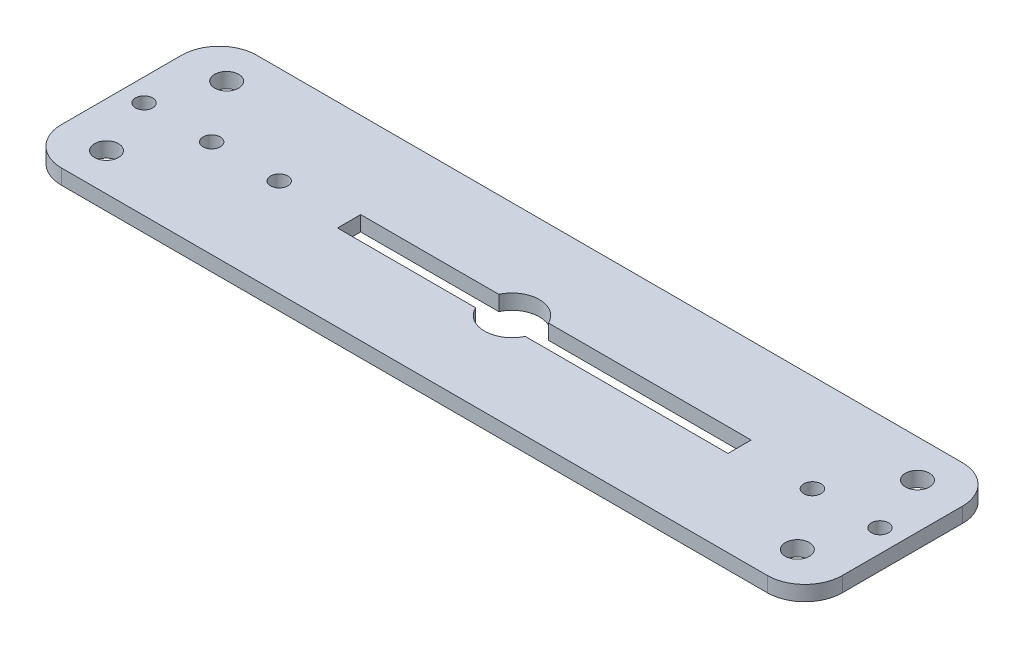
ISO-10303-21;
HEADER;
FILE_DESCRIPTION(('STEP AP214'),'2;1');
FILE_NAME('part.step','',(''),(''),'','','');
FILE_SCHEMA(('AUTOMOTIVE_DESIGN { 1 0 10303 214 1 1 1 1 }'));
ENDSEC;
DATA;
#1=APPLICATION_CONTEXT('core data for automotive mechanical design processes');
#2=APPLICATION_PROTOCOL_DEFINITION('international standard','automotive_design',2000,#1);
#3=PRODUCT_CONTEXT('',#1,'mechanical');
#4=PRODUCT('Part','Part','',(#3));
#5=PRODUCT_RELATED_PRODUCT_CATEGORY('part','',(#4));
#6=PRODUCT_DEFINITION_FORMATION('','',#4);
#7=PRODUCT_DEFINITION_CONTEXT('part definition',#1,'design');
#8=PRODUCT_DEFINITION('design','',#6,#7);
#9=PRODUCT_DEFINITION_SHAPE('','',#8);
#10=(LENGTH_UNIT() NAMED_UNIT(*) SI_UNIT(.MILLI.,.METRE.));
#11=(NAMED_UNIT(*) PLANE_ANGLE_UNIT() SI_UNIT($,.RADIAN.));
#12=(NAMED_UNIT(*) SI_UNIT($,.STERADIAN.) SOLID_ANGLE_UNIT());
#13=UNCERTAINTY_MEASURE_WITH_UNIT(LENGTH_MEASURE(1.E-05),#10,'distance_accuracy_value','');
#14=(GEOMETRIC_REPRESENTATION_CONTEXT(3) GLOBAL_UNCERTAINTY_ASSIGNED_CONTEXT((#13)) GLOBAL_UNIT_ASSIGNED_CONTEXT((#10,
#11,#12)) REPRESENTATION_CONTEXT('',''));
#15=CARTESIAN_POINT('',(0.,0.,0.));
#16=DIRECTION('',(0.,0.,1.));
#17=DIRECTION('',(1.,0.,0.));
#18=AXIS2_PLACEMENT_3D('',#15,#16,#17);
#19=CARTESIAN_POINT('',(47.,2.,-8.));
#20=DIRECTION('',(0.,1.,0.));
#21=DIRECTION('',(0.,0.,1.));
#22=AXIS2_PLACEMENT_3D('',#19,#20,#21);
#23=PLANE('',#22);
#24=CARTESIAN_POINT('',(-40.,2.,8.3410387465618E-13));
#25=DIRECTION('',(0.,1.,0.));
#26=DIRECTION('',(0.,0.,1.));
#27=AXIS2_PLACEMENT_3D('',#24,#25,#26);
#28=CIRCLE('',#27,1.15);
#29=CARTESIAN_POINT('',(-40.,2.,1.15000000000083));
#30=VERTEX_POINT('',#29);
#31=EDGE_CURVE('E412',#30,#30,#28,.T.);
#32=ORIENTED_EDGE('',*,*,#31,.F.);
#33=EDGE_LOOP('',(#32));
#34=FACE_BOUND('',#33,.T.);
#35=CARTESIAN_POINT('',(-46.,2.,-7.99999999999931));
#36=DIRECTION('',(0.,1.,0.));
#37=DIRECTION('',(0.,0.,1.));
#38=AXIS2_PLACEMENT_3D('',#35,#36,#37);
#39=CIRCLE('',#38,1.6);
#40=CARTESIAN_POINT('',(-46.,2.,-6.39999999999931));
#41=VERTEX_POINT('',#40);
#42=EDGE_CURVE('E424',#41,#41,#39,.T.);
#43=ORIENTED_EDGE('',*,*,#42,.F.);
#44=EDGE_LOOP('',(#43));
#45=FACE_BOUND('',#44,.T.);
#46=CARTESIAN_POINT('',(40.,2.,0.));
#47=DIRECTION('',(0.,1.,0.));
#48=DIRECTION('',(0.,0.,1.));
#49=AXIS2_PLACEMENT_3D('',#46,#47,#48);
#50=CIRCLE('',#49,1.15);
#51=CARTESIAN_POINT('',(40.,2.,1.14999999999999));
#52=VERTEX_POINT('',#51);
#53=EDGE_CURVE('E436',#52,#52,#50,.T.);
#54=ORIENTED_EDGE('',*,*,#53,.F.);
#55=EDGE_LOOP('',(#54));
#56=FACE_BOUND('',#55,.T.);
#57=CARTESIAN_POINT('',(46.,2.,8.));
#58=DIRECTION('',(0.,1.,0.));
#59=DIRECTION('',(0.,0.,1.));
#60=AXIS2_PLACEMENT_3D('',#57,#58,#59);
#61=CIRCLE('',#60,1.6);
#62=CARTESIAN_POINT('',(46.,2.,9.6));
#63=VERTEX_POINT('',#62);
#64=EDGE_CURVE('E448',#63,#63,#61,.T.);
#65=ORIENTED_EDGE('',*,*,#64,.F.);
#66=EDGE_LOOP('',(#65));
#67=FACE_BOUND('',#66,.T.);
#68=DIRECTION('',(-1.,0.,0.));
#69=VECTOR('',#68,1.);
#70=CARTESIAN_POINT('',(3.30714399453822,2.,-1.54444119324422));
#71=LINE('',#70,#69);
#72=CARTESIAN_POINT('',(30.3071439945382,2.,-1.54444119324422));
#73=VERTEX_POINT('',#72);
#74=CARTESIAN_POINT('',(3.30714399453822,2.,-1.54444119324422));
#75=VERTEX_POINT('',#74);
#76=EDGE_CURVE('E157',#73,#75,#71,.T.);
#77=ORIENTED_EDGE('',*,*,#76,.F.);
#78=DIRECTION('',(0.,0.,-1.));
#79=VECTOR('',#78,1.);
#80=CARTESIAN_POINT('',(30.3071439945382,2.,-1.54444119324422));
#81=LINE('',#80,#79);
#82=CARTESIAN_POINT('',(30.3071439945382,2.,1.54444119324422));
#83=VERTEX_POINT('',#82);
#84=EDGE_CURVE('E149',#83,#73,#81,.T.);
#85=ORIENTED_EDGE('',*,*,#84,.F.);
#86=DIRECTION('',(1.,0.,0.));
#87=VECTOR('',#86,1.);
#88=CARTESIAN_POINT('',(3.30714399453821,2.,1.54444119324422));
#89=LINE('',#88,#87);
#90=CARTESIAN_POINT('',(3.30714399453821,2.,1.54444119324423));
#91=VERTEX_POINT('',#90);
#92=EDGE_CURVE('E184',#91,#83,#89,.T.);
#93=ORIENTED_EDGE('',*,*,#92,.F.);
#94=CARTESIAN_POINT('',(0.,2.,0.));
#95=DIRECTION('',(0.,1.,0.));
#96=DIRECTION('',(0.,0.,1.));
#97=AXIS2_PLACEMENT_3D('',#94,#95,#96);
#98=CIRCLE('',#97,3.65);
#99=CARTESIAN_POINT('',(-3.30714399453827,2.,1.54444119324422));
#100=VERTEX_POINT('',#99);
#101=EDGE_CURVE('E182',#100,#91,#98,.T.);
#102=ORIENTED_EDGE('',*,*,#101,.F.);
#103=DIRECTION('',(1.,0.,0.));
#104=VECTOR('',#103,1.);
#105=CARTESIAN_POINT('',(-21.6928560054618,2.,1.54444119324422));
#106=LINE('',#105,#104);
#107=CARTESIAN_POINT('',(-21.6928560054618,2.,1.54444119324422));
#108=VERTEX_POINT('',#107);
#109=EDGE_CURVE('E180',#108,#100,#106,.T.);
#110=ORIENTED_EDGE('',*,*,#109,.F.);
#111=DIRECTION('',(0.,0.,1.));
#112=VECTOR('',#111,1.);
#113=CARTESIAN_POINT('',(-21.6928560054618,2.,-1.54444119324422));
#114=LINE('',#113,#112);
#115=CARTESIAN_POINT('',(-21.6928560054618,2.,-1.54444119324422));
#116=VERTEX_POINT('',#115);
#117=EDGE_CURVE('E178',#116,#108,#114,.T.);
#118=ORIENTED_EDGE('',*,*,#117,.F.);
#119=DIRECTION('',(-1.,0.,0.));
#120=VECTOR('',#119,1.);
#121=CARTESIAN_POINT('',(-21.6928560054618,2.,-1.54444119324422));
#122=LINE('',#121,#120);
#123=CARTESIAN_POINT('',(-3.30714399453827,2.,-1.54444119324422));
#124=VERTEX_POINT('',#123);
#125=EDGE_CURVE('E173',#124,#116,#122,.T.);
#126=ORIENTED_EDGE('',*,*,#125,.F.);
#127=CARTESIAN_POINT('',(0.,2.,0.));
#128=DIRECTION('',(0.,1.,0.));
#129=DIRECTION('',(0.,0.,1.));
#130=AXIS2_PLACEMENT_3D('',#127,#128,#129);
#131=CIRCLE('',#130,3.65);
#132=EDGE_CURVE('E171',#75,#124,#131,.T.);
#133=ORIENTED_EDGE('',*,*,#132,.F.);
#134=EDGE_LOOP('',(#77,#85,#93,#102,#110,#118,#126,#133));
#135=FACE_BOUND('',#134,.T.);
#136=CARTESIAN_POINT('',(47.,2.,-8.));
#137=DIRECTION('',(0.,1.,0.));
#138=DIRECTION('',(0.,0.,1.));
#139=AXIS2_PLACEMENT_3D('',#136,#137,#138);
#140=CIRCLE('',#139,5.);
#141=CARTESIAN_POINT('',(52.,2.,-8.));
#142=VERTEX_POINT('',#141);
#143=CARTESIAN_POINT('',(47.,2.,-13.));
#144=VERTEX_POINT('',#143);
#145=EDGE_CURVE('E217',#142,#144,#140,.T.);
#146=ORIENTED_EDGE('',*,*,#145,.T.);
#147=DIRECTION('',(-1.,0.,0.));
#148=VECTOR('',#147,1.);
#149=CARTESIAN_POINT('',(-47.,2.,-13.));
#150=LINE('',#149,#148);
#151=CARTESIAN_POINT('',(-47.,2.,-13.));
#152=VERTEX_POINT('',#151);
#153=EDGE_CURVE('E220',#144,#152,#150,.T.);
#154=ORIENTED_EDGE('',*,*,#153,.T.);
#155=CARTESIAN_POINT('',(-47.,2.,-8.));
#156=DIRECTION('',(0.,1.,0.));
#157=DIRECTION('',(0.,0.,-1.));
#158=AXIS2_PLACEMENT_3D('',#155,#156,#157);
#159=CIRCLE('',#158,5.);
#160=CARTESIAN_POINT('',(-52.,2.,-8.));
#161=VERTEX_POINT('',#160);
#162=EDGE_CURVE('E223',#152,#161,#159,.T.);
#163=ORIENTED_EDGE('',*,*,#162,.T.);
#164=DIRECTION('',(0.,0.,1.));
#165=VECTOR('',#164,1.);
#166=CARTESIAN_POINT('',(-52.,2.,8.));
#167=LINE('',#166,#165);
#168=CARTESIAN_POINT('',(-52.,2.,8.));
#169=VERTEX_POINT('',#168);
#170=EDGE_CURVE('E225',#161,#169,#167,.T.);
#171=ORIENTED_EDGE('',*,*,#170,.T.);
#172=CARTESIAN_POINT('',(-47.,2.,8.));
#173=DIRECTION('',(0.,1.,0.));
#174=DIRECTION('',(0.,0.,-1.));
#175=AXIS2_PLACEMENT_3D('',#172,#173,#174);
#176=CIRCLE('',#175,5.);
#177=CARTESIAN_POINT('',(-47.,2.,13.));
#178=VERTEX_POINT('',#177);
#179=EDGE_CURVE('E227',#169,#178,#176,.T.);
#180=ORIENTED_EDGE('',*,*,#179,.T.);
#181=DIRECTION('',(1.,0.,0.));
#182=VECTOR('',#181,1.);
#183=CARTESIAN_POINT('',(-47.,2.,13.));
#184=LINE('',#183,#182);
#185=CARTESIAN_POINT('',(47.,2.,13.));
#186=VERTEX_POINT('',#185);
#187=EDGE_CURVE('E229',#178,#186,#184,.T.);
#188=ORIENTED_EDGE('',*,*,#187,.T.);
#189=CARTESIAN_POINT('',(47.,2.,8.));
#190=DIRECTION('',(0.,1.,0.));
#191=DIRECTION('',(0.,0.,-1.));
#192=AXIS2_PLACEMENT_3D('',#189,#190,#191);
#193=CIRCLE('',#192,5.);
#194=CARTESIAN_POINT('',(52.,2.,8.));
#195=VERTEX_POINT('',#194);
#196=EDGE_CURVE('E231',#186,#195,#193,.T.);
#197=ORIENTED_EDGE('',*,*,#196,.T.);
#198=DIRECTION('',(0.,0.,-1.));
#199=VECTOR('',#198,1.);
#200=CARTESIAN_POINT('',(52.,2.,8.));
#201=LINE('',#200,#199);
#202=EDGE_CURVE('E233',#195,#142,#201,.T.);
#203=ORIENTED_EDGE('',*,*,#202,.T.);
#204=EDGE_LOOP('',(#146,#154,#163,#171,#180,#188,#197,#203));
#205=FACE_BOUND('',#204,.T.);
#206=CARTESIAN_POINT('',(46.,2.,-8.));
#207=DIRECTION('',(0.,1.,0.));
#208=DIRECTION('',(0.,0.,1.));
#209=AXIS2_PLACEMENT_3D('',#206,#207,#208);
#210=CIRCLE('',#209,1.6);
#211=CARTESIAN_POINT('',(46.,2.,-6.4));
#212=VERTEX_POINT('',#211);
#213=EDGE_CURVE('E187',#212,#212,#210,.T.);
#214=ORIENTED_EDGE('',*,*,#213,.F.);
#215=EDGE_LOOP('',(#214));
#216=FACE_BOUND('',#215,.T.);
#217=CARTESIAN_POINT('',(49.,2.,0.));
#218=DIRECTION('',(0.,1.,0.));
#219=DIRECTION('',(0.,0.,1.));
#220=AXIS2_PLACEMENT_3D('',#217,#218,#219);
#221=CIRCLE('',#220,1.15000000000003);
#222=CARTESIAN_POINT('',(49.,2.,1.15000000000002));
#223=VERTEX_POINT('',#222);
#224=EDGE_CURVE('E442',#223,#223,#221,.T.);
#225=ORIENTED_EDGE('',*,*,#224,.F.);
#226=EDGE_LOOP('',(#225));
#227=FACE_BOUND('',#226,.T.);
#228=CARTESIAN_POINT('',(-49.,2.,8.3410387465618E-13));
#229=DIRECTION('',(0.,1.,0.));
#230=DIRECTION('',(0.,0.,1.));
#231=AXIS2_PLACEMENT_3D('',#228,#229,#230);
#232=CIRCLE('',#231,1.15);
#233=CARTESIAN_POINT('',(-49.,2.,1.15000000000083));
#234=VERTEX_POINT('',#233);
#235=EDGE_CURVE('E430',#234,#234,#232,.T.);
#236=ORIENTED_EDGE('',*,*,#235,.F.);
#237=EDGE_LOOP('',(#236));
#238=FACE_BOUND('',#237,.T.);
#239=CARTESIAN_POINT('',(-46.,2.,8.00000000000064));
#240=DIRECTION('',(0.,1.,0.));
#241=DIRECTION('',(0.,0.,1.));
#242=AXIS2_PLACEMENT_3D('',#239,#240,#241);
#243=CIRCLE('',#242,1.6);
#244=CARTESIAN_POINT('',(-46.,2.,9.60000000000064));
#245=VERTEX_POINT('',#244);
#246=EDGE_CURVE('E418',#245,#245,#243,.T.);
#247=ORIENTED_EDGE('',*,*,#246,.F.);
#248=EDGE_LOOP('',(#247));
#249=FACE_BOUND('',#248,.T.);
#250=CARTESIAN_POINT('',(-31.,2.,8.34103791131982E-13));
#251=DIRECTION('',(0.,1.,0.));
#252=DIRECTION('',(0.,0.,1.));
#253=AXIS2_PLACEMENT_3D('',#250,#251,#252);
#254=CIRCLE('',#253,1.15);
#255=CARTESIAN_POINT('',(-31.,2.,1.15000000000083));
#256=VERTEX_POINT('',#255);
#257=EDGE_CURVE('E403',#256,#256,#254,.T.);
#258=ORIENTED_EDGE('',*,*,#257,.F.);
#259=EDGE_LOOP('',(#258));
#260=FACE_BOUND('',#259,.T.);
#261=ADVANCED_FACE('F36',(#34,#45,#56,#67,#135,#205,#216,#227,#238,#249,#260),#23,.T.);
#262=CARTESIAN_POINT('',(47.,0.,-8.));
#263=DIRECTION('',(0.,1.,0.));
#264=DIRECTION('',(0.,0.,1.));
#265=AXIS2_PLACEMENT_3D('',#262,#263,#264);
#266=PLANE('',#265);
#267=CARTESIAN_POINT('',(-40.,0.,8.3410387465618E-13));
#268=DIRECTION('',(0.,1.,0.));
#269=DIRECTION('',(0.,0.,1.));
#270=AXIS2_PLACEMENT_3D('',#267,#268,#269);
#271=CIRCLE('',#270,1.15);
#272=CARTESIAN_POINT('',(-40.,0.,1.15000000000083));
#273=VERTEX_POINT('',#272);
#274=EDGE_CURVE('E409',#273,#273,#271,.T.);
#275=ORIENTED_EDGE('',*,*,#274,.T.);
#276=EDGE_LOOP('',(#275));
#277=FACE_BOUND('',#276,.T.);
#278=CARTESIAN_POINT('',(-46.,0.,-7.99999999999931));
#279=DIRECTION('',(0.,1.,0.));
#280=DIRECTION('',(0.,0.,1.));
#281=AXIS2_PLACEMENT_3D('',#278,#279,#280);
#282=CIRCLE('',#281,1.6);
#283=CARTESIAN_POINT('',(-46.,0.,-6.39999999999931));
#284=VERTEX_POINT('',#283);
#285=EDGE_CURVE('E421',#284,#284,#282,.T.);
#286=ORIENTED_EDGE('',*,*,#285,.T.);
#287=EDGE_LOOP('',(#286));
#288=FACE_BOUND('',#287,.T.);
#289=CARTESIAN_POINT('',(40.,0.,0.));
#290=DIRECTION('',(0.,1.,0.));
#291=DIRECTION('',(0.,0.,1.));
#292=AXIS2_PLACEMENT_3D('',#289,#290,#291);
#293=CIRCLE('',#292,1.15);
#294=CARTESIAN_POINT('',(40.,0.,1.14999999999999));
#295=VERTEX_POINT('',#294);
#296=EDGE_CURVE('E433',#295,#295,#293,.T.);
#297=ORIENTED_EDGE('',*,*,#296,.T.);
#298=EDGE_LOOP('',(#297));
#299=FACE_BOUND('',#298,.T.);
#300=CARTESIAN_POINT('',(46.,0.,8.));
#301=DIRECTION('',(0.,1.,0.));
#302=DIRECTION('',(0.,0.,1.));
#303=AXIS2_PLACEMENT_3D('',#300,#301,#302);
#304=CIRCLE('',#303,1.6);
#305=CARTESIAN_POINT('',(46.,0.,9.6));
#306=VERTEX_POINT('',#305);
#307=EDGE_CURVE('E445',#306,#306,#304,.T.);
#308=ORIENTED_EDGE('',*,*,#307,.T.);
#309=EDGE_LOOP('',(#308));
#310=FACE_BOUND('',#309,.T.);
#311=DIRECTION('',(0.,0.,-1.));
#312=VECTOR('',#311,1.);
#313=CARTESIAN_POINT('',(30.3071439945382,0.,-1.54444119324422));
#314=LINE('',#313,#312);
#315=CARTESIAN_POINT('',(30.3071439945382,0.,1.54444119324423));
#316=VERTEX_POINT('',#315);
#317=CARTESIAN_POINT('',(30.3071439945382,0.,-1.54444119324422));
#318=VERTEX_POINT('',#317);
#319=EDGE_CURVE('E59',#316,#318,#314,.T.);
#320=ORIENTED_EDGE('',*,*,#319,.T.);
#321=DIRECTION('',(-1.,0.,0.));
#322=VECTOR('',#321,1.);
#323=CARTESIAN_POINT('',(3.30714399453822,0.,-1.54444119324422));
#324=LINE('',#323,#322);
#325=CARTESIAN_POINT('',(3.30714399453822,0.,-1.54444119324422));
#326=VERTEX_POINT('',#325);
#327=EDGE_CURVE('E164',#318,#326,#324,.T.);
#328=ORIENTED_EDGE('',*,*,#327,.T.);
#329=CARTESIAN_POINT('',(0.,0.,0.));
#330=DIRECTION('',(0.,1.,0.));
#331=DIRECTION('',(0.,0.,1.));
#332=AXIS2_PLACEMENT_3D('',#329,#330,#331);
#333=CIRCLE('',#332,3.65);
#334=CARTESIAN_POINT('',(-3.30714399453827,0.,-1.54444119324422));
#335=VERTEX_POINT('',#334);
#336=EDGE_CURVE('E189',#326,#335,#333,.T.);
#337=ORIENTED_EDGE('',*,*,#336,.T.);
#338=DIRECTION('',(-1.,0.,0.));
#339=VECTOR('',#338,1.);
#340=CARTESIAN_POINT('',(-21.6928560054618,0.,-1.54444119324422));
#341=LINE('',#340,#339);
#342=CARTESIAN_POINT('',(-21.6928560054618,0.,-1.54444119324422));
#343=VERTEX_POINT('',#342);
#344=EDGE_CURVE('E192',#335,#343,#341,.T.);
#345=ORIENTED_EDGE('',*,*,#344,.T.);
#346=DIRECTION('',(0.,0.,1.));
#347=VECTOR('',#346,1.);
#348=CARTESIAN_POINT('',(-21.6928560054618,0.,-1.54444119324422));
#349=LINE('',#348,#347);
#350=CARTESIAN_POINT('',(-21.6928560054618,0.,1.54444119324422));
#351=VERTEX_POINT('',#350);
#352=EDGE_CURVE('E195',#343,#351,#349,.T.);
#353=ORIENTED_EDGE('',*,*,#352,.T.);
#354=DIRECTION('',(1.,0.,0.));
#355=VECTOR('',#354,1.);
#356=CARTESIAN_POINT('',(-21.6928560054618,0.,1.54444119324422));
#357=LINE('',#356,#355);
#358=CARTESIAN_POINT('',(-3.30714399453827,0.,1.54444119324422));
#359=VERTEX_POINT('',#358);
#360=EDGE_CURVE('E198',#351,#359,#357,.T.);
#361=ORIENTED_EDGE('',*,*,#360,.T.);
#362=CARTESIAN_POINT('',(0.,0.,0.));
#363=DIRECTION('',(0.,1.,0.));
#364=DIRECTION('',(0.,0.,1.));
#365=AXIS2_PLACEMENT_3D('',#362,#363,#364);
#366=CIRCLE('',#365,3.65);
#367=CARTESIAN_POINT('',(3.30714399453821,0.,1.54444119324422));
#368=VERTEX_POINT('',#367);
#369=EDGE_CURVE('E201',#359,#368,#366,.T.);
#370=ORIENTED_EDGE('',*,*,#369,.T.);
#371=DIRECTION('',(1.,0.,0.));
#372=VECTOR('',#371,1.);
#373=CARTESIAN_POINT('',(3.30714399453821,0.,1.54444119324422));
#374=LINE('',#373,#372);
#375=EDGE_CURVE('E158',#368,#316,#374,.T.);
#376=ORIENTED_EDGE('',*,*,#375,.T.);
#377=EDGE_LOOP('',(#320,#328,#337,#345,#353,#361,#370,#376));
#378=FACE_BOUND('',#377,.T.);
#379=CARTESIAN_POINT('',(47.,0.,-8.));
#380=DIRECTION('',(0.,1.,0.));
#381=DIRECTION('',(0.,0.,1.));
#382=AXIS2_PLACEMENT_3D('',#379,#380,#381);
#383=CIRCLE('',#382,5.);
#384=CARTESIAN_POINT('',(52.,0.,-8.));
#385=VERTEX_POINT('',#384);
#386=CARTESIAN_POINT('',(47.,0.,-13.));
#387=VERTEX_POINT('',#386);
#388=EDGE_CURVE('E165',#385,#387,#383,.T.);
#389=ORIENTED_EDGE('',*,*,#388,.F.);
#390=DIRECTION('',(0.,0.,-1.));
#391=VECTOR('',#390,1.);
#392=CARTESIAN_POINT('',(52.,0.,8.));
#393=LINE('',#392,#391);
#394=CARTESIAN_POINT('',(52.,0.,8.));
#395=VERTEX_POINT('',#394);
#396=EDGE_CURVE('E221',#395,#385,#393,.T.);
#397=ORIENTED_EDGE('',*,*,#396,.F.);
#398=CARTESIAN_POINT('',(47.,0.,8.));
#399=DIRECTION('',(0.,1.,0.));
#400=DIRECTION('',(0.,0.,-1.));
#401=AXIS2_PLACEMENT_3D('',#398,#399,#400);
#402=CIRCLE('',#401,5.);
#403=CARTESIAN_POINT('',(47.,0.,13.));
#404=VERTEX_POINT('',#403);
#405=EDGE_CURVE('E248',#404,#395,#402,.T.);
#406=ORIENTED_EDGE('',*,*,#405,.F.);
#407=DIRECTION('',(1.,0.,0.));
#408=VECTOR('',#407,1.);
#409=CARTESIAN_POINT('',(-47.,0.,13.));
#410=LINE('',#409,#408);
#411=CARTESIAN_POINT('',(-47.,0.,13.));
#412=VERTEX_POINT('',#411);
#413=EDGE_CURVE('E246',#412,#404,#410,.T.);
#414=ORIENTED_EDGE('',*,*,#413,.F.);
#415=CARTESIAN_POINT('',(-47.,0.,8.));
#416=DIRECTION('',(0.,1.,0.));
#417=DIRECTION('',(0.,0.,-1.));
#418=AXIS2_PLACEMENT_3D('',#415,#416,#417);
#419=CIRCLE('',#418,5.);
#420=CARTESIAN_POINT('',(-52.,0.,8.));
#421=VERTEX_POINT('',#420);
#422=EDGE_CURVE('E244',#421,#412,#419,.T.);
#423=ORIENTED_EDGE('',*,*,#422,.F.);
#424=DIRECTION('',(0.,0.,1.));
#425=VECTOR('',#424,1.);
#426=CARTESIAN_POINT('',(-52.,0.,8.));
#427=LINE('',#426,#425);
#428=CARTESIAN_POINT('',(-52.,0.,-8.));
#429=VERTEX_POINT('',#428);
#430=EDGE_CURVE('E242',#429,#421,#427,.T.);
#431=ORIENTED_EDGE('',*,*,#430,.F.);
#432=CARTESIAN_POINT('',(-47.,0.,-8.));
#433=DIRECTION('',(0.,1.,0.));
#434=DIRECTION('',(0.,0.,-1.));
#435=AXIS2_PLACEMENT_3D('',#432,#433,#434);
#436=CIRCLE('',#435,5.);
#437=CARTESIAN_POINT('',(-47.,0.,-13.));
#438=VERTEX_POINT('',#437);
#439=EDGE_CURVE('E240',#438,#429,#436,.T.);
#440=ORIENTED_EDGE('',*,*,#439,.F.);
#441=DIRECTION('',(-1.,0.,0.));
#442=VECTOR('',#441,1.);
#443=CARTESIAN_POINT('',(-47.,0.,-13.));
#444=LINE('',#443,#442);
#445=EDGE_CURVE('E238',#387,#438,#444,.T.);
#446=ORIENTED_EDGE('',*,*,#445,.F.);
#447=EDGE_LOOP('',(#389,#397,#406,#414,#423,#431,#440,#446));
#448=FACE_BOUND('',#447,.T.);
#449=CARTESIAN_POINT('',(46.,0.,-8.));
#450=DIRECTION('',(0.,1.,0.));
#451=DIRECTION('',(0.,0.,1.));
#452=AXIS2_PLACEMENT_3D('',#449,#450,#451);
#453=CIRCLE('',#452,1.6);
#454=CARTESIAN_POINT('',(46.,0.,-6.4));
#455=VERTEX_POINT('',#454);
#456=EDGE_CURVE('E451',#455,#455,#453,.T.);
#457=ORIENTED_EDGE('',*,*,#456,.T.);
#458=EDGE_LOOP('',(#457));
#459=FACE_BOUND('',#458,.T.);
#460=CARTESIAN_POINT('',(49.,0.,0.));
#461=DIRECTION('',(0.,1.,0.));
#462=DIRECTION('',(0.,0.,1.));
#463=AXIS2_PLACEMENT_3D('',#460,#461,#462);
#464=CIRCLE('',#463,1.15000000000003);
#465=CARTESIAN_POINT('',(49.,0.,1.15000000000002));
#466=VERTEX_POINT('',#465);
#467=EDGE_CURVE('E439',#466,#466,#464,.T.);
#468=ORIENTED_EDGE('',*,*,#467,.T.);
#469=EDGE_LOOP('',(#468));
#470=FACE_BOUND('',#469,.T.);
#471=CARTESIAN_POINT('',(-49.,0.,8.3410387465618E-13));
#472=DIRECTION('',(0.,1.,0.));
#473=DIRECTION('',(0.,0.,1.));
#474=AXIS2_PLACEMENT_3D('',#471,#472,#473);
#475=CIRCLE('',#474,1.15);
#476=CARTESIAN_POINT('',(-49.,0.,1.15000000000083));
#477=VERTEX_POINT('',#476);
#478=EDGE_CURVE('E427',#477,#477,#475,.T.);
#479=ORIENTED_EDGE('',*,*,#478,.T.);
#480=EDGE_LOOP('',(#479));
#481=FACE_BOUND('',#480,.T.);
#482=CARTESIAN_POINT('',(-46.,0.,8.00000000000064));
#483=DIRECTION('',(0.,1.,0.));
#484=DIRECTION('',(0.,0.,1.));
#485=AXIS2_PLACEMENT_3D('',#482,#483,#484);
#486=CIRCLE('',#485,1.6);
#487=CARTESIAN_POINT('',(-46.,0.,9.60000000000064));
#488=VERTEX_POINT('',#487);
#489=EDGE_CURVE('E415',#488,#488,#486,.T.);
#490=ORIENTED_EDGE('',*,*,#489,.T.);
#491=EDGE_LOOP('',(#490));
#492=FACE_BOUND('',#491,.T.);
#493=CARTESIAN_POINT('',(-31.,0.,8.34103791131982E-13));
#494=DIRECTION('',(0.,1.,0.));
#495=DIRECTION('',(0.,0.,1.));
#496=AXIS2_PLACEMENT_3D('',#493,#494,#495);
#497=CIRCLE('',#496,1.15);
#498=CARTESIAN_POINT('',(-31.,0.,1.15000000000083));
#499=VERTEX_POINT('',#498);
#500=EDGE_CURVE('E406',#499,#499,#497,.T.);
#501=ORIENTED_EDGE('',*,*,#500,.T.);
#502=EDGE_LOOP('',(#501));
#503=FACE_BOUND('',#502,.T.);
#504=ADVANCED_FACE('F278',(#277,#288,#299,#310,#378,#448,#459,#470,#481,#492,#503),#266,.F.);
#505=CARTESIAN_POINT('',(47.,2.,-8.));
#506=DIRECTION('',(0.,-1.,0.));
#507=DIRECTION('',(0.,0.,-1.));
#508=AXIS2_PLACEMENT_3D('',#505,#506,#507);
#509=CYLINDRICAL_SURFACE('',#508,5.);
#510=ORIENTED_EDGE('',*,*,#388,.T.);
#511=DIRECTION('',(0.,-1.,0.));
#512=VECTOR('',#511,1.);
#513=CARTESIAN_POINT('',(47.,2.,-13.));
#514=LINE('',#513,#512);
#515=EDGE_CURVE('E11',#144,#387,#514,.T.);
#516=ORIENTED_EDGE('',*,*,#515,.F.);
#517=ORIENTED_EDGE('',*,*,#145,.F.);
#518=DIRECTION('',(0.,-1.,0.));
#519=VECTOR('',#518,1.);
#520=CARTESIAN_POINT('',(52.,2.,-8.));
#521=LINE('',#520,#519);
#522=EDGE_CURVE('E235',#142,#385,#521,.T.);
#523=ORIENTED_EDGE('',*,*,#522,.T.);
#524=EDGE_LOOP('',(#510,#516,#517,#523));
#525=FACE_BOUND('',#524,.T.);
#526=ADVANCED_FACE('F38',(#525),#509,.T.);
#527=CARTESIAN_POINT('',(-47.,2.,-13.));
#528=DIRECTION('',(0.,0.,1.));
#529=DIRECTION('',(1.,0.,0.));
#530=AXIS2_PLACEMENT_3D('',#527,#528,#529);
#531=PLANE('',#530);
#532=ORIENTED_EDGE('',*,*,#445,.T.);
#533=DIRECTION('',(0.,-1.,0.));
#534=VECTOR('',#533,1.);
#535=CARTESIAN_POINT('',(-47.,2.,-13.));
#536=LINE('',#535,#534);
#537=EDGE_CURVE('E44',#152,#438,#536,.T.);
#538=ORIENTED_EDGE('',*,*,#537,.F.);
#539=ORIENTED_EDGE('',*,*,#153,.F.);
#540=ORIENTED_EDGE('',*,*,#515,.T.);
#541=EDGE_LOOP('',(#532,#538,#539,#540));
#542=FACE_BOUND('',#541,.T.);
#543=ADVANCED_FACE('F295',(#542),#531,.F.);
#544=CARTESIAN_POINT('',(-47.,2.,-8.));
#545=DIRECTION('',(0.,-1.,0.));
#546=DIRECTION('',(0.,0.,-1.));
#547=AXIS2_PLACEMENT_3D('',#544,#545,#546);
#548=CYLINDRICAL_SURFACE('',#547,5.);
#549=ORIENTED_EDGE('',*,*,#439,.T.);
#550=DIRECTION('',(0.,-1.,0.));
#551=VECTOR('',#550,1.);
#552=CARTESIAN_POINT('',(-52.,2.,-8.));
#553=LINE('',#552,#551);
#554=EDGE_CURVE('E265',#161,#429,#553,.T.);
#555=ORIENTED_EDGE('',*,*,#554,.F.);
#556=ORIENTED_EDGE('',*,*,#162,.F.);
#557=ORIENTED_EDGE('',*,*,#537,.T.);
#558=EDGE_LOOP('',(#549,#555,#556,#557));
#559=FACE_BOUND('',#558,.T.);
#560=ADVANCED_FACE('F272',(#559),#548,.T.);
#561=CARTESIAN_POINT('',(-52.,2.,8.));
#562=DIRECTION('',(1.,0.,0.));
#563=DIRECTION('',(0.,0.,-1.));
#564=AXIS2_PLACEMENT_3D('',#561,#562,#563);
#565=PLANE('',#564);
#566=ORIENTED_EDGE('',*,*,#430,.T.);
#567=DIRECTION('',(0.,-1.,0.));
#568=VECTOR('',#567,1.);
#569=CARTESIAN_POINT('',(-52.,2.,8.));
#570=LINE('',#569,#568);
#571=EDGE_CURVE('E262',#169,#421,#570,.T.);
#572=ORIENTED_EDGE('',*,*,#571,.F.);
#573=ORIENTED_EDGE('',*,*,#170,.F.);
#574=ORIENTED_EDGE('',*,*,#554,.T.);
#575=EDGE_LOOP('',(#566,#572,#573,#574));
#576=FACE_BOUND('',#575,.T.);
#577=ADVANCED_FACE('F284',(#576),#565,.F.);
#578=CARTESIAN_POINT('',(-47.,2.,8.));
#579=DIRECTION('',(0.,-1.,0.));
#580=DIRECTION('',(0.,0.,-1.));
#581=AXIS2_PLACEMENT_3D('',#578,#579,#580);
#582=CYLINDRICAL_SURFACE('',#581,5.);
#583=ORIENTED_EDGE('',*,*,#422,.T.);
#584=DIRECTION('',(0.,-1.,0.));
#585=VECTOR('',#584,1.);
#586=CARTESIAN_POINT('',(-47.,2.,13.));
#587=LINE('',#586,#585);
#588=EDGE_CURVE('E259',#178,#412,#587,.T.);
#589=ORIENTED_EDGE('',*,*,#588,.F.);
#590=ORIENTED_EDGE('',*,*,#179,.F.);
#591=ORIENTED_EDGE('',*,*,#571,.T.);
#592=EDGE_LOOP('',(#583,#589,#590,#591));
#593=FACE_BOUND('',#592,.T.);
#594=ADVANCED_FACE('F288',(#593),#582,.T.);
#595=CARTESIAN_POINT('',(-47.,2.,13.));
#596=DIRECTION('',(0.,0.,-1.));
#597=DIRECTION('',(-1.,0.,0.));
#598=AXIS2_PLACEMENT_3D('',#595,#596,#597);
#599=PLANE('',#598);
#600=ORIENTED_EDGE('',*,*,#413,.T.);
#601=DIRECTION('',(0.,-1.,0.));
#602=VECTOR('',#601,1.);
#603=CARTESIAN_POINT('',(47.,2.,13.));
#604=LINE('',#603,#602);
#605=EDGE_CURVE('E256',#186,#404,#604,.T.);
#606=ORIENTED_EDGE('',*,*,#605,.F.);
#607=ORIENTED_EDGE('',*,*,#187,.F.);
#608=ORIENTED_EDGE('',*,*,#588,.T.);
#609=EDGE_LOOP('',(#600,#606,#607,#608));
#610=FACE_BOUND('',#609,.T.);
#611=ADVANCED_FACE('F308',(#610),#599,.F.);
#612=CARTESIAN_POINT('',(47.,2.,8.));
#613=DIRECTION('',(0.,-1.,0.));
#614=DIRECTION('',(0.,0.,-1.));
#615=AXIS2_PLACEMENT_3D('',#612,#613,#614);
#616=CYLINDRICAL_SURFACE('',#615,5.);
#617=ORIENTED_EDGE('',*,*,#405,.T.);
#618=DIRECTION('',(0.,-1.,0.));
#619=VECTOR('',#618,1.);
#620=CARTESIAN_POINT('',(52.,2.,8.));
#621=LINE('',#620,#619);
#622=EDGE_CURVE('E253',#195,#395,#621,.T.);
#623=ORIENTED_EDGE('',*,*,#622,.F.);
#624=ORIENTED_EDGE('',*,*,#196,.F.);
#625=ORIENTED_EDGE('',*,*,#605,.T.);
#626=EDGE_LOOP('',(#617,#623,#624,#625));
#627=FACE_BOUND('',#626,.T.);
#628=ADVANCED_FACE('F306',(#627),#616,.T.);
#629=CARTESIAN_POINT('',(52.,2.,8.));
#630=DIRECTION('',(-1.,0.,0.));
#631=DIRECTION('',(0.,0.,1.));
#632=AXIS2_PLACEMENT_3D('',#629,#630,#631);
#633=PLANE('',#632);
#634=ORIENTED_EDGE('',*,*,#396,.T.);
#635=ORIENTED_EDGE('',*,*,#522,.F.);
#636=ORIENTED_EDGE('',*,*,#202,.F.);
#637=ORIENTED_EDGE('',*,*,#622,.T.);
#638=EDGE_LOOP('',(#634,#635,#636,#637));
#639=FACE_BOUND('',#638,.T.);
#640=ADVANCED_FACE('F301',(#639),#633,.F.);
#641=CARTESIAN_POINT('',(30.3071439945382,2.,-1.54444119324422));
#642=DIRECTION('',(-1.,0.,0.));
#643=DIRECTION('',(0.,0.,1.));
#644=AXIS2_PLACEMENT_3D('',#641,#642,#643);
#645=PLANE('',#644);
#646=ORIENTED_EDGE('',*,*,#319,.F.);
#647=DIRECTION('',(0.,-1.,0.));
#648=VECTOR('',#647,1.);
#649=CARTESIAN_POINT('',(30.3071439945382,2.,1.54444119324422));
#650=LINE('',#649,#648);
#651=EDGE_CURVE('E153',#83,#316,#650,.T.);
#652=ORIENTED_EDGE('',*,*,#651,.F.);
#653=ORIENTED_EDGE('',*,*,#84,.T.);
#654=DIRECTION('',(0.,-1.,0.));
#655=VECTOR('',#654,1.);
#656=CARTESIAN_POINT('',(30.3071439945382,2.,-1.54444119324422));
#657=LINE('',#656,#655);
#658=EDGE_CURVE('E152',#73,#318,#657,.T.);
#659=ORIENTED_EDGE('',*,*,#658,.T.);
#660=EDGE_LOOP('',(#646,#652,#653,#659));
#661=FACE_BOUND('',#660,.T.);
#662=ADVANCED_FACE('F151',(#661),#645,.T.);
#663=CARTESIAN_POINT('',(3.30714399453822,2.,-1.54444119324422));
#664=DIRECTION('',(0.,0.,1.));
#665=DIRECTION('',(1.,0.,0.));
#666=AXIS2_PLACEMENT_3D('',#663,#664,#665);
#667=PLANE('',#666);
#668=ORIENTED_EDGE('',*,*,#327,.F.);
#669=ORIENTED_EDGE('',*,*,#658,.F.);
#670=ORIENTED_EDGE('',*,*,#76,.T.);
#671=DIRECTION('',(0.,-1.,0.));
#672=VECTOR('',#671,1.);
#673=CARTESIAN_POINT('',(3.30714399453822,2.,-1.54444119324422));
#674=LINE('',#673,#672);
#675=EDGE_CURVE('E166',#75,#326,#674,.T.);
#676=ORIENTED_EDGE('',*,*,#675,.T.);
#677=EDGE_LOOP('',(#668,#669,#670,#676));
#678=FACE_BOUND('',#677,.T.);
#679=ADVANCED_FACE('F161',(#678),#667,.T.);
#680=CARTESIAN_POINT('',(0.,2.,0.));
#681=DIRECTION('',(0.,-1.,0.));
#682=DIRECTION('',(0.,0.,-1.));
#683=AXIS2_PLACEMENT_3D('',#680,#681,#682);
#684=CYLINDRICAL_SURFACE('',#683,3.65);
#685=ORIENTED_EDGE('',*,*,#336,.F.);
#686=ORIENTED_EDGE('',*,*,#675,.F.);
#687=ORIENTED_EDGE('',*,*,#132,.T.);
#688=DIRECTION('',(0.,-1.,0.));
#689=VECTOR('',#688,1.);
#690=CARTESIAN_POINT('',(-3.30714399453827,2.,-1.54444119324422));
#691=LINE('',#690,#689);
#692=EDGE_CURVE('E214',#124,#335,#691,.T.);
#693=ORIENTED_EDGE('',*,*,#692,.T.);
#694=EDGE_LOOP('',(#685,#686,#687,#693));
#695=FACE_BOUND('',#694,.T.);
#696=ADVANCED_FACE('F337',(#695),#684,.F.);
#697=CARTESIAN_POINT('',(-21.6928560054618,2.,-1.54444119324422));
#698=DIRECTION('',(0.,0.,1.));
#699=DIRECTION('',(1.,0.,0.));
#700=AXIS2_PLACEMENT_3D('',#697,#698,#699);
#701=PLANE('',#700);
#702=ORIENTED_EDGE('',*,*,#344,.F.);
#703=ORIENTED_EDGE('',*,*,#692,.F.);
#704=ORIENTED_EDGE('',*,*,#125,.T.);
#705=DIRECTION('',(0.,-1.,0.));
#706=VECTOR('',#705,1.);
#707=CARTESIAN_POINT('',(-21.6928560054618,2.,-1.54444119324422));
#708=LINE('',#707,#706);
#709=EDGE_CURVE('E212',#116,#343,#708,.T.);
#710=ORIENTED_EDGE('',*,*,#709,.T.);
#711=EDGE_LOOP('',(#702,#703,#704,#710));
#712=FACE_BOUND('',#711,.T.);
#713=ADVANCED_FACE('F341',(#712),#701,.T.);
#714=CARTESIAN_POINT('',(-21.6928560054618,2.,-1.54444119324422));
#715=DIRECTION('',(1.,0.,0.));
#716=DIRECTION('',(0.,0.,-1.));
#717=AXIS2_PLACEMENT_3D('',#714,#715,#716);
#718=PLANE('',#717);
#719=ORIENTED_EDGE('',*,*,#352,.F.);
#720=ORIENTED_EDGE('',*,*,#709,.F.);
#721=ORIENTED_EDGE('',*,*,#117,.T.);
#722=DIRECTION('',(0.,-1.,0.));
#723=VECTOR('',#722,1.);
#724=CARTESIAN_POINT('',(-21.6928560054618,2.,1.54444119324422));
#725=LINE('',#724,#723);
#726=EDGE_CURVE('E210',#108,#351,#725,.T.);
#727=ORIENTED_EDGE('',*,*,#726,.T.);
#728=EDGE_LOOP('',(#719,#720,#721,#727));
#729=FACE_BOUND('',#728,.T.);
#730=ADVANCED_FACE('F347',(#729),#718,.T.);
#731=CARTESIAN_POINT('',(-21.6928560054618,2.,1.54444119324422));
#732=DIRECTION('',(0.,0.,-1.));
#733=DIRECTION('',(-1.,0.,0.));
#734=AXIS2_PLACEMENT_3D('',#731,#732,#733);
#735=PLANE('',#734);
#736=ORIENTED_EDGE('',*,*,#360,.F.);
#737=ORIENTED_EDGE('',*,*,#726,.F.);
#738=ORIENTED_EDGE('',*,*,#109,.T.);
#739=DIRECTION('',(0.,-1.,0.));
#740=VECTOR('',#739,1.);
#741=CARTESIAN_POINT('',(-3.30714399453827,2.,1.54444119324422));
#742=LINE('',#741,#740);
#743=EDGE_CURVE('E208',#100,#359,#742,.T.);
#744=ORIENTED_EDGE('',*,*,#743,.T.);
#745=EDGE_LOOP('',(#736,#737,#738,#744));
#746=FACE_BOUND('',#745,.T.);
#747=ADVANCED_FACE('F351',(#746),#735,.T.);
#748=CARTESIAN_POINT('',(0.,2.,0.));
#749=DIRECTION('',(0.,-1.,0.));
#750=DIRECTION('',(0.,0.,-1.));
#751=AXIS2_PLACEMENT_3D('',#748,#749,#750);
#752=CYLINDRICAL_SURFACE('',#751,3.65);
#753=ORIENTED_EDGE('',*,*,#369,.F.);
#754=ORIENTED_EDGE('',*,*,#743,.F.);
#755=ORIENTED_EDGE('',*,*,#101,.T.);
#756=DIRECTION('',(0.,-1.,0.));
#757=VECTOR('',#756,1.);
#758=CARTESIAN_POINT('',(3.30714399453821,2.,1.54444119324422));
#759=LINE('',#758,#757);
#760=EDGE_CURVE('E51',#91,#368,#759,.T.);
#761=ORIENTED_EDGE('',*,*,#760,.T.);
#762=EDGE_LOOP('',(#753,#754,#755,#761));
#763=FACE_BOUND('',#762,.T.);
#764=ADVANCED_FACE('F355',(#763),#752,.F.);
#765=CARTESIAN_POINT('',(3.30714399453821,2.,1.54444119324422));
#766=DIRECTION('',(0.,0.,-1.));
#767=DIRECTION('',(-1.,0.,0.));
#768=AXIS2_PLACEMENT_3D('',#765,#766,#767);
#769=PLANE('',#768);
#770=ORIENTED_EDGE('',*,*,#375,.F.);
#771=ORIENTED_EDGE('',*,*,#760,.F.);
#772=ORIENTED_EDGE('',*,*,#92,.T.);
#773=ORIENTED_EDGE('',*,*,#651,.T.);
#774=EDGE_LOOP('',(#770,#771,#772,#773));
#775=FACE_BOUND('',#774,.T.);
#776=ADVANCED_FACE('F359',(#775),#769,.T.);
#777=CARTESIAN_POINT('',(46.,2.,-8.));
#778=DIRECTION('',(0.,-1.,0.));
#779=DIRECTION('',(0.,0.,-1.));
#780=AXIS2_PLACEMENT_3D('',#777,#778,#779);
#781=CYLINDRICAL_SURFACE('',#780,1.6);
#782=ORIENTED_EDGE('',*,*,#213,.T.);
#783=EDGE_LOOP('',(#782));
#784=FACE_BOUND('',#783,.T.);
#785=ORIENTED_EDGE('',*,*,#456,.F.);
#786=EDGE_LOOP('',(#785));
#787=FACE_BOUND('',#786,.T.);
#788=ADVANCED_FACE('F363',(#784,#787),#781,.F.);
#789=CARTESIAN_POINT('',(46.,2.,8.));
#790=DIRECTION('',(0.,-1.,0.));
#791=DIRECTION('',(0.,0.,-1.));
#792=AXIS2_PLACEMENT_3D('',#789,#790,#791);
#793=CYLINDRICAL_SURFACE('',#792,1.6);
#794=ORIENTED_EDGE('',*,*,#64,.T.);
#795=EDGE_LOOP('',(#794));
#796=FACE_BOUND('',#795,.T.);
#797=ORIENTED_EDGE('',*,*,#307,.F.);
#798=EDGE_LOOP('',(#797));
#799=FACE_BOUND('',#798,.T.);
#800=ADVANCED_FACE('F366',(#796,#799),#793,.F.);
#801=CARTESIAN_POINT('',(49.,2.,0.));
#802=DIRECTION('',(0.,-1.,0.));
#803=DIRECTION('',(0.,0.,-1.));
#804=AXIS2_PLACEMENT_3D('',#801,#802,#803);
#805=CYLINDRICAL_SURFACE('',#804,1.15000000000003);
#806=ORIENTED_EDGE('',*,*,#224,.T.);
#807=EDGE_LOOP('',(#806));
#808=FACE_BOUND('',#807,.T.);
#809=ORIENTED_EDGE('',*,*,#467,.F.);
#810=EDGE_LOOP('',(#809));
#811=FACE_BOUND('',#810,.T.);
#812=ADVANCED_FACE('F370',(#808,#811),#805,.F.);
#813=CARTESIAN_POINT('',(40.,2.,0.));
#814=DIRECTION('',(0.,-1.,0.));
#815=DIRECTION('',(0.,0.,-1.));
#816=AXIS2_PLACEMENT_3D('',#813,#814,#815);
#817=CYLINDRICAL_SURFACE('',#816,1.15);
#818=ORIENTED_EDGE('',*,*,#53,.T.);
#819=EDGE_LOOP('',(#818));
#820=FACE_BOUND('',#819,.T.);
#821=ORIENTED_EDGE('',*,*,#296,.F.);
#822=EDGE_LOOP('',(#821));
#823=FACE_BOUND('',#822,.T.);
#824=ADVANCED_FACE('F374',(#820,#823),#817,.F.);
#825=CARTESIAN_POINT('',(-49.,2.,8.3410387465618E-13));
#826=DIRECTION('',(0.,-1.,0.));
#827=DIRECTION('',(0.,0.,-1.));
#828=AXIS2_PLACEMENT_3D('',#825,#826,#827);
#829=CYLINDRICAL_SURFACE('',#828,1.15);
#830=ORIENTED_EDGE('',*,*,#235,.T.);
#831=EDGE_LOOP('',(#830));
#832=FACE_BOUND('',#831,.T.);
#833=ORIENTED_EDGE('',*,*,#478,.F.);
#834=EDGE_LOOP('',(#833));
#835=FACE_BOUND('',#834,.T.);
#836=ADVANCED_FACE('F378',(#832,#835),#829,.F.);
#837=CARTESIAN_POINT('',(-46.,2.,-7.99999999999931));
#838=DIRECTION('',(0.,-1.,0.));
#839=DIRECTION('',(0.,0.,-1.));
#840=AXIS2_PLACEMENT_3D('',#837,#838,#839);
#841=CYLINDRICAL_SURFACE('',#840,1.6);
#842=ORIENTED_EDGE('',*,*,#42,.T.);
#843=EDGE_LOOP('',(#842));
#844=FACE_BOUND('',#843,.T.);
#845=ORIENTED_EDGE('',*,*,#285,.F.);
#846=EDGE_LOOP('',(#845));
#847=FACE_BOUND('',#846,.T.);
#848=ADVANCED_FACE('F382',(#844,#847),#841,.F.);
#849=CARTESIAN_POINT('',(-46.,2.,8.00000000000064));
#850=DIRECTION('',(0.,-1.,0.));
#851=DIRECTION('',(0.,0.,-1.));
#852=AXIS2_PLACEMENT_3D('',#849,#850,#851);
#853=CYLINDRICAL_SURFACE('',#852,1.6);
#854=ORIENTED_EDGE('',*,*,#246,.T.);
#855=EDGE_LOOP('',(#854));
#856=FACE_BOUND('',#855,.T.);
#857=ORIENTED_EDGE('',*,*,#489,.F.);
#858=EDGE_LOOP('',(#857));
#859=FACE_BOUND('',#858,.T.);
#860=ADVANCED_FACE('F386',(#856,#859),#853,.F.);
#861=CARTESIAN_POINT('',(-40.,2.,8.3410387465618E-13));
#862=DIRECTION('',(0.,-1.,0.));
#863=DIRECTION('',(0.,0.,-1.));
#864=AXIS2_PLACEMENT_3D('',#861,#862,#863);
#865=CYLINDRICAL_SURFACE('',#864,1.15);
#866=ORIENTED_EDGE('',*,*,#31,.T.);
#867=EDGE_LOOP('',(#866));
#868=FACE_BOUND('',#867,.T.);
#869=ORIENTED_EDGE('',*,*,#274,.F.);
#870=EDGE_LOOP('',(#869));
#871=FACE_BOUND('',#870,.T.);
#872=ADVANCED_FACE('F390',(#868,#871),#865,.F.);
#873=CARTESIAN_POINT('',(-31.,2.,8.34103791131982E-13));
#874=DIRECTION('',(0.,-1.,0.));
#875=DIRECTION('',(0.,0.,-1.));
#876=AXIS2_PLACEMENT_3D('',#873,#874,#875);
#877=CYLINDRICAL_SURFACE('',#876,1.15);
#878=ORIENTED_EDGE('',*,*,#257,.T.);
#879=EDGE_LOOP('',(#878));
#880=FACE_BOUND('',#879,.T.);
#881=ORIENTED_EDGE('',*,*,#500,.F.);
#882=EDGE_LOOP('',(#881));
#883=FACE_BOUND('',#882,.T.);
#884=ADVANCED_FACE('F394',(#880,#883),#877,.F.);
#885=CLOSED_SHELL('',(#261,#504,#526,#543,#560,#577,#594,#611,#628,#640,#662,#679,#696,#713,
#730,#747,#764,#776,#788,#800,#812,#824,#836,#848,#860,#872,#884));
#886=MANIFOLD_SOLID_BREP('B2',#885);
#887=ADVANCED_BREP_SHAPE_REPRESENTATION('',(#18,#886),#14);
#888=SHAPE_DEFINITION_REPRESENTATION(#9,#887);
ENDSEC;
END-ISO-10303-21;
